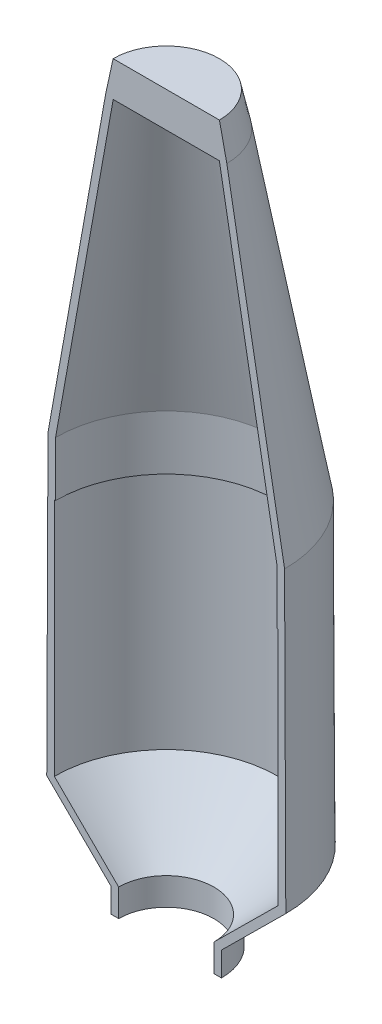
ISO-10303-21;
HEADER;
FILE_DESCRIPTION(('STEP AP214'),'2;1');
FILE_NAME('part.step','',(''),(''),'','','');
FILE_SCHEMA(('AUTOMOTIVE_DESIGN { 1 0 10303 214 1 1 1 1 }'));
ENDSEC;
DATA;
#1=APPLICATION_CONTEXT('core data for automotive mechanical design processes');
#2=APPLICATION_PROTOCOL_DEFINITION('international standard','automotive_design',2000,#1);
#3=PRODUCT_CONTEXT('',#1,'mechanical');
#4=PRODUCT('Part','Part','',(#3));
#5=PRODUCT_RELATED_PRODUCT_CATEGORY('part','',(#4));
#6=PRODUCT_DEFINITION_FORMATION('','',#4);
#7=PRODUCT_DEFINITION_CONTEXT('part definition',#1,'design');
#8=PRODUCT_DEFINITION('design','',#6,#7);
#9=PRODUCT_DEFINITION_SHAPE('','',#8);
#10=(LENGTH_UNIT() NAMED_UNIT(*) SI_UNIT(.MILLI.,.METRE.));
#11=(NAMED_UNIT(*) PLANE_ANGLE_UNIT() SI_UNIT($,.RADIAN.));
#12=(NAMED_UNIT(*) SI_UNIT($,.STERADIAN.) SOLID_ANGLE_UNIT());
#13=UNCERTAINTY_MEASURE_WITH_UNIT(LENGTH_MEASURE(1.E-05),#10,'distance_accuracy_value','');
#14=(GEOMETRIC_REPRESENTATION_CONTEXT(3) GLOBAL_UNCERTAINTY_ASSIGNED_CONTEXT((#13)) GLOBAL_UNIT_ASSIGNED_CONTEXT((#10,
#11,#12)) REPRESENTATION_CONTEXT('',''));
#15=CARTESIAN_POINT('',(0.,0.,0.));
#16=DIRECTION('',(0.,0.,1.));
#17=DIRECTION('',(1.,0.,0.));
#18=AXIS2_PLACEMENT_3D('',#15,#16,#17);
#19=CARTESIAN_POINT('',(0.,5386.324,-888.999999999999));
#20=DIRECTION('',(0.,-1.,0.));
#21=DIRECTION('',(0.,0.,-1.));
#22=AXIS2_PLACEMENT_3D('',#19,#20,#21);
#23=PLANE('',#22);
#24=DIRECTION('',(1.,0.,0.));
#25=VECTOR('',#24,1.);
#26=CARTESIAN_POINT('',(0.,5386.324,8.88178419700125E-13));
#27=LINE('',#26,#25);
#28=CARTESIAN_POINT('',(-888.999999999999,5386.324,8.49762311838734E-13));
#29=VERTEX_POINT('',#28);
#30=CARTESIAN_POINT('',(888.999999999999,5386.324,8.88178419700125E-13));
#31=VERTEX_POINT('',#30);
#32=EDGE_CURVE('E136',#29,#31,#27,.T.);
#33=ORIENTED_EDGE('',*,*,#32,.F.);
#34=CARTESIAN_POINT('',(0.,5386.324,0.));
#35=DIRECTION('',(0.,-1.,0.));
#36=DIRECTION('',(0.,0.,-1.));
#37=AXIS2_PLACEMENT_3D('',#34,#35,#36);
#38=CIRCLE('',#37,888.999999999999);
#39=EDGE_CURVE('E162',#29,#31,#38,.T.);
#40=ORIENTED_EDGE('',*,*,#39,.T.);
#41=EDGE_LOOP('',(#33,#40));
#42=FACE_BOUND('',#41,.T.);
#43=ADVANCED_FACE('F30',(#42),#23,.T.);
#44=CARTESIAN_POINT('',(0.,5408.72489867263,0.));
#45=DIRECTION('',(0.,-1.,0.));
#46=DIRECTION('',(0.,0.,-1.));
#47=AXIS2_PLACEMENT_3D('',#44,#45,#46);
#48=CONICAL_SURFACE('',#47,1014.00879864497,0.214123281670925);
#49=DIRECTION('',(0.212490813305486,-0.977163064314638,0.));
#50=VECTOR('',#49,1.);
#51=CARTESIAN_POINT('',(0.,10071.7591706599,1.1544214678519E-12));
#52=LINE('',#51,#50);
#53=CARTESIAN_POINT('',(1014.00879864497,5408.72489867263,8.51218876412774E-13));
#54=VERTEX_POINT('',#53);
#55=CARTESIAN_POINT('',(890.40397749423,5977.13566392335,8.88178419700125E-13));
#56=VERTEX_POINT('',#55);
#57=EDGE_CURVE('E130',#54,#56,#52,.F.);
#58=ORIENTED_EDGE('',*,*,#57,.F.);
#59=CARTESIAN_POINT('',(0.,5408.72489867263,0.));
#60=DIRECTION('',(0.,-1.,0.));
#61=DIRECTION('',(0.,0.,-1.));
#62=AXIS2_PLACEMENT_3D('',#59,#60,#61);
#63=CIRCLE('',#62,1014.00879864497);
#64=CARTESIAN_POINT('',(-1014.00879864497,5408.72489867263,8.51218876412774E-13));
#65=VERTEX_POINT('',#64);
#66=EDGE_CURVE('E135',#65,#54,#63,.T.);
#67=ORIENTED_EDGE('',*,*,#66,.F.);
#68=DIRECTION('',(0.212490813305486,0.977163064314638,0.));
#69=VECTOR('',#68,1.);
#70=CARTESIAN_POINT('',(0.,10071.7591706599,1.1544214678519E-12));
#71=LINE('',#70,#69);
#72=CARTESIAN_POINT('',(-890.40397749423,5977.13566392335,8.88178419700125E-13));
#73=VERTEX_POINT('',#72);
#74=EDGE_CURVE('E128',#73,#65,#71,.F.);
#75=ORIENTED_EDGE('',*,*,#74,.F.);
#76=CARTESIAN_POINT('',(0.,5977.13566392335,2.3807138142913E-13));
#77=DIRECTION('',(0.,-1.,0.));
#78=DIRECTION('',(0.,0.,-1.));
#79=AXIS2_PLACEMENT_3D('',#76,#77,#78);
#80=CIRCLE('',#79,890.40397749423);
#81=EDGE_CURVE('E11',#56,#73,#80,.F.);
#82=ORIENTED_EDGE('',*,*,#81,.F.);
#83=EDGE_LOOP('',(#58,#67,#75,#82));
#84=FACE_BOUND('',#83,.T.);
#85=ADVANCED_FACE('F133',(#84),#48,.T.);
#86=CARTESIAN_POINT('',(0.,11.2892016348477,0.));
#87=DIRECTION('',(0.,-1.,0.));
#88=DIRECTION('',(0.,0.,-1.));
#89=AXIS2_PLACEMENT_3D('',#86,#87,#88);
#90=CONICAL_SURFACE('',#89,1981.2,0.177312681615657);
#91=DIRECTION('',(0.176385028918344,-0.98432124917299,0.));
#92=VECTOR('',#91,1.);
#93=CARTESIAN_POINT('',(0.,11067.4274171085,1.21916240152903E-12));
#94=LINE('',#93,#92);
#95=CARTESIAN_POINT('',(1981.2,11.2892016348383,5.00263598151321E-13));
#96=VERTEX_POINT('',#95);
#97=EDGE_CURVE('E51',#96,#54,#94,.F.);
#98=ORIENTED_EDGE('',*,*,#97,.F.);
#99=CARTESIAN_POINT('',(0.,11.2892016348477,0.));
#100=DIRECTION('',(0.,-1.,0.));
#101=DIRECTION('',(0.,0.,-1.));
#102=AXIS2_PLACEMENT_3D('',#99,#100,#101);
#103=CIRCLE('',#102,1981.2);
#104=CARTESIAN_POINT('',(-1981.2,11.2892016348383,5.00263598151321E-13));
#105=VERTEX_POINT('',#104);
#106=EDGE_CURVE('E192',#105,#96,#103,.T.);
#107=ORIENTED_EDGE('',*,*,#106,.F.);
#108=DIRECTION('',(0.176385028918344,0.98432124917299,0.));
#109=VECTOR('',#108,1.);
#110=CARTESIAN_POINT('',(0.,11067.4274171085,1.21916240152903E-12));
#111=LINE('',#110,#109);
#112=EDGE_CURVE('E137',#65,#105,#111,.F.);
#113=ORIENTED_EDGE('',*,*,#112,.F.);
#114=ORIENTED_EDGE('',*,*,#66,.T.);
#115=EDGE_LOOP('',(#98,#107,#113,#114));
#116=FACE_BOUND('',#115,.T.);
#117=ADVANCED_FACE('F213',(#116),#90,.T.);
#118=CARTESIAN_POINT('',(0.,-4978.03097816896,0.));
#119=DIRECTION('',(0.,-1.,0.));
#120=DIRECTION('',(0.,0.,-1.));
#121=AXIS2_PLACEMENT_3D('',#118,#119,#120);
#122=CONICAL_SURFACE('',#121,2002.028,0.00417449236843432);
#123=DIRECTION('',(0.00417448024405862,-0.999991286819386,0.));
#124=VECTOR('',#123,1.);
#125=CARTESIAN_POINT('',(0.,474605.159963464,3.13595889006841E-11));
#126=LINE('',#125,#124);
#127=CARTESIAN_POINT('',(2002.028,-4978.03097816896,1.75845050099068E-13));
#128=VERTEX_POINT('',#127);
#129=EDGE_CURVE('E158',#128,#96,#126,.F.);
#130=ORIENTED_EDGE('',*,*,#129,.F.);
#131=CARTESIAN_POINT('',(0.,-4978.03097816896,0.));
#132=DIRECTION('',(0.,-1.,0.));
#133=DIRECTION('',(0.,0.,-1.));
#134=AXIS2_PLACEMENT_3D('',#131,#132,#133);
#135=CIRCLE('',#134,2002.028);
#136=CARTESIAN_POINT('',(-2002.028,-4978.03097816896,1.75845050099068E-13));
#137=VERTEX_POINT('',#136);
#138=EDGE_CURVE('E189',#137,#128,#135,.T.);
#139=ORIENTED_EDGE('',*,*,#138,.F.);
#140=DIRECTION('',(0.00417448024405862,0.999991286819386,0.));
#141=VECTOR('',#140,1.);
#142=CARTESIAN_POINT('',(0.,474605.159963464,3.13595889006841E-11));
#143=LINE('',#142,#141);
#144=EDGE_CURVE('E141',#105,#137,#143,.F.);
#145=ORIENTED_EDGE('',*,*,#144,.F.);
#146=ORIENTED_EDGE('',*,*,#106,.T.);
#147=EDGE_LOOP('',(#130,#139,#145,#146));
#148=FACE_BOUND('',#147,.T.);
#149=ADVANCED_FACE('F217',(#148),#122,.T.);
#150=CARTESIAN_POINT('',(0.,-6044.83097816896,0.));
#151=DIRECTION('',(0.,1.,0.));
#152=DIRECTION('',(0.,0.,1.));
#153=AXIS2_PLACEMENT_3D('',#150,#151,#152);
#154=CONICAL_SURFACE('',#153,924.687000000001,0.790314311673033);
#155=DIRECTION('',(-0.710574464124136,0.703622008563332,0.));
#156=VECTOR('',#155,1.);
#157=CARTESIAN_POINT('',(0.,-6960.47058679799,0.));
#158=LINE('',#157,#156);
#159=CARTESIAN_POINT('',(-924.687000000001,-6044.83097816896,4.99529544959504E-13));
#160=VERTEX_POINT('',#159);
#161=EDGE_CURVE('E370',#137,#160,#158,.F.);
#162=ORIENTED_EDGE('',*,*,#161,.F.);
#163=ORIENTED_EDGE('',*,*,#138,.T.);
#164=DIRECTION('',(-0.710574464124136,-0.703622008563332,0.));
#165=VECTOR('',#164,1.);
#166=CARTESIAN_POINT('',(0.,-6960.47058679799,0.));
#167=LINE('',#166,#165);
#168=CARTESIAN_POINT('',(924.687000000001,-6044.83097816896,4.99529544959504E-13));
#169=VERTEX_POINT('',#168);
#170=EDGE_CURVE('E156',#169,#128,#167,.F.);
#171=ORIENTED_EDGE('',*,*,#170,.F.);
#172=CARTESIAN_POINT('',(0.,-6044.83097816896,0.));
#173=DIRECTION('',(0.,-1.,0.));
#174=DIRECTION('',(0.,0.,-1.));
#175=AXIS2_PLACEMENT_3D('',#172,#173,#174);
#176=CIRCLE('',#175,924.687000000001);
#177=EDGE_CURVE('E186',#160,#169,#176,.T.);
#178=ORIENTED_EDGE('',*,*,#177,.F.);
#179=EDGE_LOOP('',(#162,#163,#171,#178));
#180=FACE_BOUND('',#179,.T.);
#181=ADVANCED_FACE('F223',(#180),#154,.T.);
#182=CARTESIAN_POINT('',(0.,0.,0.));
#183=DIRECTION('',(0.,-1.,0.));
#184=DIRECTION('',(0.,0.,-1.));
#185=AXIS2_PLACEMENT_3D('',#182,#183,#184);
#186=CYLINDRICAL_SURFACE('',#185,924.687000000001);
#187=DIRECTION('',(0.,-1.,0.));
#188=VECTOR('',#187,1.);
#189=CARTESIAN_POINT('',(924.687000000001,0.,4.99529544959504E-13));
#190=LINE('',#189,#188);
#191=CARTESIAN_POINT('',(924.687000000001,-6450.58555960543,1.11022302462516E-13));
#192=VERTEX_POINT('',#191);
#193=EDGE_CURVE('E154',#192,#169,#190,.F.);
#194=ORIENTED_EDGE('',*,*,#193,.F.);
#195=CARTESIAN_POINT('',(0.,-6450.58555960543,0.));
#196=DIRECTION('',(0.,-1.,0.));
#197=DIRECTION('',(0.,0.,-1.));
#198=AXIS2_PLACEMENT_3D('',#195,#196,#197);
#199=CIRCLE('',#198,924.687000000001);
#200=CARTESIAN_POINT('',(-924.687000000001,-6450.58555960543,1.11022302462516E-13));
#201=VERTEX_POINT('',#200);
#202=EDGE_CURVE('E183',#201,#192,#199,.T.);
#203=ORIENTED_EDGE('',*,*,#202,.F.);
#204=DIRECTION('',(0.,-1.,0.));
#205=VECTOR('',#204,1.);
#206=CARTESIAN_POINT('',(-924.687000000001,0.,4.99529544959504E-13));
#207=LINE('',#206,#205);
#208=EDGE_CURVE('E369',#160,#201,#207,.T.);
#209=ORIENTED_EDGE('',*,*,#208,.F.);
#210=ORIENTED_EDGE('',*,*,#177,.T.);
#211=EDGE_LOOP('',(#194,#203,#209,#210));
#212=FACE_BOUND('',#211,.T.);
#213=ADVANCED_FACE('F227',(#212),#186,.T.);
#214=CARTESIAN_POINT('',(0.,-6450.58555960543,-797.687000000001));
#215=DIRECTION('',(0.,-1.,0.));
#216=DIRECTION('',(0.,0.,-1.));
#217=AXIS2_PLACEMENT_3D('',#214,#215,#216);
#218=PLANE('',#217);
#219=DIRECTION('',(1.,0.,0.));
#220=VECTOR('',#219,1.);
#221=CARTESIAN_POINT('',(0.,-6450.58555960543,1.11022302462516E-13));
#222=LINE('',#221,#220);
#223=CARTESIAN_POINT('',(-797.687000000001,-6450.58555960543,4.99529544959504E-13));
#224=VERTEX_POINT('',#223);
#225=EDGE_CURVE('E366',#201,#224,#222,.T.);
#226=ORIENTED_EDGE('',*,*,#225,.F.);
#227=ORIENTED_EDGE('',*,*,#202,.T.);
#228=CARTESIAN_POINT('',(797.687000000001,-6450.58555960543,4.99529544959504E-13));
#229=VERTEX_POINT('',#228);
#230=EDGE_CURVE('E153',#229,#192,#222,.T.);
#231=ORIENTED_EDGE('',*,*,#230,.F.);
#232=CARTESIAN_POINT('',(0.,-6450.58555960543,0.));
#233=DIRECTION('',(0.,-1.,0.));
#234=DIRECTION('',(0.,0.,-1.));
#235=AXIS2_PLACEMENT_3D('',#232,#233,#234);
#236=CIRCLE('',#235,797.687000000001);
#237=EDGE_CURVE('E180',#224,#229,#236,.T.);
#238=ORIENTED_EDGE('',*,*,#237,.F.);
#239=EDGE_LOOP('',(#226,#227,#231,#238));
#240=FACE_BOUND('',#239,.T.);
#241=ADVANCED_FACE('F231',(#240),#218,.T.);
#242=CARTESIAN_POINT('',(0.,0.,0.));
#243=DIRECTION('',(0.,-1.,0.));
#244=DIRECTION('',(0.,0.,-1.));
#245=AXIS2_PLACEMENT_3D('',#242,#243,#244);
#246=CYLINDRICAL_SURFACE('',#245,797.687000000001);
#247=DIRECTION('',(0.,-1.,0.));
#248=VECTOR('',#247,1.);
#249=CARTESIAN_POINT('',(797.687000000001,0.,4.99529544959504E-13));
#250=LINE('',#249,#248);
#251=CARTESIAN_POINT('',(797.687000000001,-5991.859746,1.09923272185369E-13));
#252=VERTEX_POINT('',#251);
#253=EDGE_CURVE('E151',#252,#229,#250,.T.);
#254=ORIENTED_EDGE('',*,*,#253,.F.);
#255=CARTESIAN_POINT('',(0.,-5991.859746,0.));
#256=DIRECTION('',(0.,-1.,0.));
#257=DIRECTION('',(0.,0.,-1.));
#258=AXIS2_PLACEMENT_3D('',#255,#256,#257);
#259=CIRCLE('',#258,797.687000000001);
#260=CARTESIAN_POINT('',(-797.687000000001,-5991.859746,1.09923272185369E-13));
#261=VERTEX_POINT('',#260);
#262=EDGE_CURVE('E177',#261,#252,#259,.T.);
#263=ORIENTED_EDGE('',*,*,#262,.F.);
#264=DIRECTION('',(0.,-1.,0.));
#265=VECTOR('',#264,1.);
#266=CARTESIAN_POINT('',(-797.687000000001,0.,4.99529544959504E-13));
#267=LINE('',#266,#265);
#268=EDGE_CURVE('E359',#224,#261,#267,.F.);
#269=ORIENTED_EDGE('',*,*,#268,.F.);
#270=ORIENTED_EDGE('',*,*,#237,.T.);
#271=EDGE_LOOP('',(#254,#263,#269,#270));
#272=FACE_BOUND('',#271,.T.);
#273=ADVANCED_FACE('F235',(#272),#246,.F.);
#274=CARTESIAN_POINT('',(0.,-4925.059746,0.));
#275=DIRECTION('',(0.,1.,0.));
#276=DIRECTION('',(0.,0.,1.));
#277=AXIS2_PLACEMENT_3D('',#274,#275,#276);
#278=CONICAL_SURFACE('',#277,1875.028,0.790314311673033);
#279=DIRECTION('',(-0.710574464124136,0.703622008563332,0.));
#280=VECTOR('',#279,1.);
#281=CARTESIAN_POINT('',(0.,-6781.74195748179,0.));
#282=LINE('',#281,#280);
#283=CARTESIAN_POINT('',(-1875.028,-4925.059746,4.99529544959504E-13));
#284=VERTEX_POINT('',#283);
#285=EDGE_CURVE('E357',#261,#284,#282,.T.);
#286=ORIENTED_EDGE('',*,*,#285,.F.);
#287=ORIENTED_EDGE('',*,*,#262,.T.);
#288=DIRECTION('',(-0.710574464124136,-0.703622008563332,0.));
#289=VECTOR('',#288,1.);
#290=CARTESIAN_POINT('',(0.,-6781.74195748179,0.));
#291=LINE('',#290,#289);
#292=CARTESIAN_POINT('',(1875.028,-4925.059746,4.99529544959504E-13));
#293=VERTEX_POINT('',#292);
#294=EDGE_CURVE('E149',#293,#252,#291,.T.);
#295=ORIENTED_EDGE('',*,*,#294,.F.);
#296=CARTESIAN_POINT('',(0.,-4925.059746,0.));
#297=DIRECTION('',(0.,-1.,0.));
#298=DIRECTION('',(0.,0.,-1.));
#299=AXIS2_PLACEMENT_3D('',#296,#297,#298);
#300=CIRCLE('',#299,1875.028);
#301=EDGE_CURVE('E174',#284,#293,#300,.T.);
#302=ORIENTED_EDGE('',*,*,#301,.F.);
#303=EDGE_LOOP('',(#286,#287,#295,#302));
#304=FACE_BOUND('',#303,.T.);
#305=ADVANCED_FACE('F239',(#304),#278,.F.);
#306=CARTESIAN_POINT('',(0.,0.,0.));
#307=DIRECTION('',(0.,-1.,0.));
#308=DIRECTION('',(0.,0.,-1.));
#309=AXIS2_PLACEMENT_3D('',#306,#307,#308);
#310=CYLINDRICAL_SURFACE('',#309,1875.028);
#311=DIRECTION('',(0.,-1.,0.));
#312=VECTOR('',#311,1.);
#313=CARTESIAN_POINT('',(1875.028,0.,4.99529544959504E-13));
#314=LINE('',#313,#312);
#315=CARTESIAN_POINT('',(1875.028,-914.399745999999,4.44089209850063E-13));
#316=VERTEX_POINT('',#315);
#317=EDGE_CURVE('E147',#316,#293,#314,.T.);
#318=ORIENTED_EDGE('',*,*,#317,.F.);
#319=CARTESIAN_POINT('',(0.,-914.399745999999,0.));
#320=DIRECTION('',(0.,-1.,0.));
#321=DIRECTION('',(0.,0.,-1.));
#322=AXIS2_PLACEMENT_3D('',#319,#320,#321);
#323=CIRCLE('',#322,1875.028);
#324=CARTESIAN_POINT('',(-1875.028,-914.399745999999,4.44089209850063E-13));
#325=VERTEX_POINT('',#324);
#326=EDGE_CURVE('E171',#325,#316,#323,.T.);
#327=ORIENTED_EDGE('',*,*,#326,.F.);
#328=DIRECTION('',(0.,-1.,0.));
#329=VECTOR('',#328,1.);
#330=CARTESIAN_POINT('',(-1875.028,0.,4.99529544959504E-13));
#331=LINE('',#330,#329);
#332=EDGE_CURVE('E348',#284,#325,#331,.F.);
#333=ORIENTED_EDGE('',*,*,#332,.F.);
#334=ORIENTED_EDGE('',*,*,#301,.T.);
#335=EDGE_LOOP('',(#318,#327,#333,#334));
#336=FACE_BOUND('',#335,.T.);
#337=ADVANCED_FACE('F243',(#336),#310,.F.);
#338=CARTESIAN_POINT('',(0.,-914.399745999999,-1854.2));
#339=DIRECTION('',(0.,-1.,0.));
#340=DIRECTION('',(0.,0.,-1.));
#341=AXIS2_PLACEMENT_3D('',#338,#339,#340);
#342=PLANE('',#341);
#343=DIRECTION('',(1.,0.,0.));
#344=VECTOR('',#343,1.);
#345=CARTESIAN_POINT('',(0.,-914.399745999999,4.44089209850063E-13));
#346=LINE('',#345,#344);
#347=CARTESIAN_POINT('',(-1854.2,-914.399745999999,4.99529544959504E-13));
#348=VERTEX_POINT('',#347);
#349=EDGE_CURVE('E346',#325,#348,#346,.T.);
#350=ORIENTED_EDGE('',*,*,#349,.F.);
#351=ORIENTED_EDGE('',*,*,#326,.T.);
#352=CARTESIAN_POINT('',(1854.2,-914.399745999999,4.99529544959504E-13));
#353=VERTEX_POINT('',#352);
#354=EDGE_CURVE('E146',#353,#316,#346,.T.);
#355=ORIENTED_EDGE('',*,*,#354,.F.);
#356=CARTESIAN_POINT('',(0.,-914.399745999999,0.));
#357=DIRECTION('',(0.,-1.,0.));
#358=DIRECTION('',(0.,0.,-1.));
#359=AXIS2_PLACEMENT_3D('',#356,#357,#358);
#360=CIRCLE('',#359,1854.2);
#361=EDGE_CURVE('E168',#348,#353,#360,.T.);
#362=ORIENTED_EDGE('',*,*,#361,.F.);
#363=EDGE_LOOP('',(#350,#351,#355,#362));
#364=FACE_BOUND('',#363,.T.);
#365=ADVANCED_FACE('F247',(#364),#342,.T.);
#366=CARTESIAN_POINT('',(0.,0.,0.));
#367=DIRECTION('',(0.,-1.,0.));
#368=DIRECTION('',(0.,0.,-1.));
#369=AXIS2_PLACEMENT_3D('',#366,#367,#368);
#370=CYLINDRICAL_SURFACE('',#369,1854.2);
#371=DIRECTION('',(0.,-1.,0.));
#372=VECTOR('',#371,1.);
#373=CARTESIAN_POINT('',(1854.2,0.,4.99529544959504E-13));
#374=LINE('',#373,#372);
#375=CARTESIAN_POINT('',(1854.2,0.000254000001476129,4.99529561475243E-13));
#376=VERTEX_POINT('',#375);
#377=EDGE_CURVE('E139',#376,#353,#374,.T.);
#378=ORIENTED_EDGE('',*,*,#377,.F.);
#379=CARTESIAN_POINT('',(0.,0.00025400000060056,0.));
#380=DIRECTION('',(0.,-1.,0.));
#381=DIRECTION('',(0.,0.,-1.));
#382=AXIS2_PLACEMENT_3D('',#379,#380,#381);
#383=CIRCLE('',#382,1854.2);
#384=CARTESIAN_POINT('',(-1854.2,0.00025400000060056,4.99529561475243E-13));
#385=VERTEX_POINT('',#384);
#386=EDGE_CURVE('E165',#385,#376,#383,.T.);
#387=ORIENTED_EDGE('',*,*,#386,.F.);
#388=DIRECTION('',(0.,-1.,0.));
#389=VECTOR('',#388,1.);
#390=CARTESIAN_POINT('',(-1854.2,0.,4.99529544959504E-13));
#391=LINE('',#390,#389);
#392=EDGE_CURVE('E44',#348,#385,#391,.F.);
#393=ORIENTED_EDGE('',*,*,#392,.F.);
#394=ORIENTED_EDGE('',*,*,#361,.T.);
#395=EDGE_LOOP('',(#378,#387,#393,#394));
#396=FACE_BOUND('',#395,.T.);
#397=ADVANCED_FACE('F205',(#396),#370,.F.);
#398=CARTESIAN_POINT('',(0.,5386.324,0.));
#399=DIRECTION('',(0.,-1.,0.));
#400=DIRECTION('',(0.,0.,-1.));
#401=AXIS2_PLACEMENT_3D('',#398,#399,#400);
#402=CONICAL_SURFACE('',#401,888.999999999999,0.177312681615657);
#403=DIRECTION('',(0.176385028918344,-0.98432124917299,0.));
#404=VECTOR('',#403,1.);
#405=CARTESIAN_POINT('',(0.,10347.4116607895,1.17234510822616E-12));
#406=LINE('',#405,#404);
#407=EDGE_CURVE('E37',#31,#376,#406,.T.);
#408=ORIENTED_EDGE('',*,*,#407,.F.);
#409=ORIENTED_EDGE('',*,*,#39,.F.);
#410=DIRECTION('',(0.176385028918344,0.98432124917299,0.));
#411=VECTOR('',#410,1.);
#412=CARTESIAN_POINT('',(0.,10347.4116607895,1.17234510822616E-12));
#413=LINE('',#412,#411);
#414=EDGE_CURVE('E196',#385,#29,#413,.T.);
#415=ORIENTED_EDGE('',*,*,#414,.F.);
#416=ORIENTED_EDGE('',*,*,#386,.T.);
#417=EDGE_LOOP('',(#408,#409,#415,#416));
#418=FACE_BOUND('',#417,.T.);
#419=ADVANCED_FACE('F207',(#418),#402,.F.);
#420=CARTESIAN_POINT('',(-2540.,-7682.39933887239,0.));
#421=DIRECTION('',(0.,0.,-1.));
#422=DIRECTION('',(0.,1.,0.));
#423=AXIS2_PLACEMENT_3D('',#420,#421,#422);
#424=PLANE('',#423);
#425=ORIENTED_EDGE('',*,*,#57,.T.);
#426=DIRECTION('',(1.,0.,0.));
#427=VECTOR('',#426,1.);
#428=CARTESIAN_POINT('',(-2540.,5977.13566392335,8.88178419700125E-13));
#429=LINE('',#428,#427);
#430=EDGE_CURVE('E124',#73,#56,#429,.T.);
#431=ORIENTED_EDGE('',*,*,#430,.F.);
#432=ORIENTED_EDGE('',*,*,#74,.T.);
#433=ORIENTED_EDGE('',*,*,#112,.T.);
#434=ORIENTED_EDGE('',*,*,#144,.T.);
#435=ORIENTED_EDGE('',*,*,#161,.T.);
#436=ORIENTED_EDGE('',*,*,#208,.T.);
#437=ORIENTED_EDGE('',*,*,#225,.T.);
#438=ORIENTED_EDGE('',*,*,#268,.T.);
#439=ORIENTED_EDGE('',*,*,#285,.T.);
#440=ORIENTED_EDGE('',*,*,#332,.T.);
#441=ORIENTED_EDGE('',*,*,#349,.T.);
#442=ORIENTED_EDGE('',*,*,#392,.T.);
#443=ORIENTED_EDGE('',*,*,#414,.T.);
#444=ORIENTED_EDGE('',*,*,#32,.T.);
#445=ORIENTED_EDGE('',*,*,#407,.T.);
#446=ORIENTED_EDGE('',*,*,#377,.T.);
#447=ORIENTED_EDGE('',*,*,#354,.T.);
#448=ORIENTED_EDGE('',*,*,#317,.T.);
#449=ORIENTED_EDGE('',*,*,#294,.T.);
#450=ORIENTED_EDGE('',*,*,#253,.T.);
#451=ORIENTED_EDGE('',*,*,#230,.T.);
#452=ORIENTED_EDGE('',*,*,#193,.T.);
#453=ORIENTED_EDGE('',*,*,#170,.T.);
#454=ORIENTED_EDGE('',*,*,#129,.T.);
#455=ORIENTED_EDGE('',*,*,#97,.T.);
#456=EDGE_LOOP('',(#425,#431,#432,#433,#434,#435,#436,#437,#438,#439,#440,#441,#442,#443,#444,
#445,#446,#447,#448,#449,#450,#451,#452,#453,#454,#455));
#457=FACE_BOUND('',#456,.T.);
#458=ADVANCED_FACE('F127',(#457),#424,.F.);
#459=CARTESIAN_POINT('',(-2540.,5977.13566392335,-7037.61437719135));
#460=DIRECTION('',(0.,-1.,0.));
#461=DIRECTION('',(0.,0.,-1.));
#462=AXIS2_PLACEMENT_3D('',#459,#460,#461);
#463=PLANE('',#462);
#464=ORIENTED_EDGE('',*,*,#81,.T.);
#465=ORIENTED_EDGE('',*,*,#430,.T.);
#466=EDGE_LOOP('',(#464,#465));
#467=FACE_BOUND('',#466,.T.);
#468=ADVANCED_FACE('F123',(#467),#463,.F.);
#469=CLOSED_SHELL('',(#43,#85,#117,#149,#181,#213,#241,#273,#305,#337,#365,#397,#419,#458,#468));
#470=MANIFOLD_SOLID_BREP('B2',#469);
#471=ADVANCED_BREP_SHAPE_REPRESENTATION('',(#18,#470),#14);
#472=SHAPE_DEFINITION_REPRESENTATION(#9,#471);
ENDSEC;
END-ISO-10303-21;
